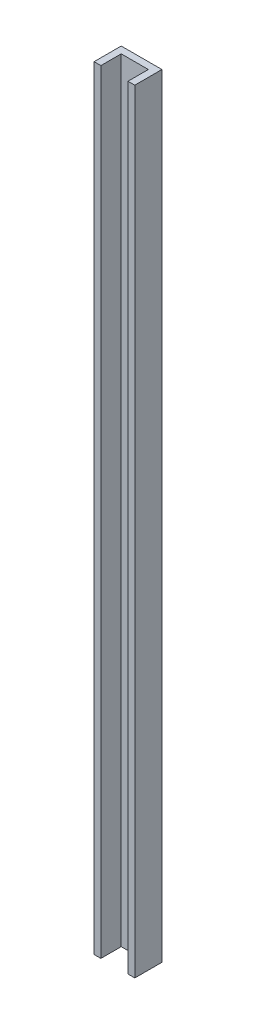
ISO-10303-21;
HEADER;
FILE_DESCRIPTION(('STEP AP214'),'2;1');
FILE_NAME('part.step','',(''),(''),'','','');
FILE_SCHEMA(('AUTOMOTIVE_DESIGN { 1 0 10303 214 1 1 1 1 }'));
ENDSEC;
DATA;
#1=APPLICATION_CONTEXT('core data for automotive mechanical design processes');
#2=APPLICATION_PROTOCOL_DEFINITION('international standard','automotive_design',2000,#1);
#3=PRODUCT_CONTEXT('',#1,'mechanical');
#4=PRODUCT('Part','Part','',(#3));
#5=PRODUCT_RELATED_PRODUCT_CATEGORY('part','',(#4));
#6=PRODUCT_DEFINITION_FORMATION('','',#4);
#7=PRODUCT_DEFINITION_CONTEXT('part definition',#1,'design');
#8=PRODUCT_DEFINITION('design','',#6,#7);
#9=PRODUCT_DEFINITION_SHAPE('','',#8);
#10=(LENGTH_UNIT() NAMED_UNIT(*) SI_UNIT(.MILLI.,.METRE.));
#11=(NAMED_UNIT(*) PLANE_ANGLE_UNIT() SI_UNIT($,.RADIAN.));
#12=(NAMED_UNIT(*) SI_UNIT($,.STERADIAN.) SOLID_ANGLE_UNIT());
#13=UNCERTAINTY_MEASURE_WITH_UNIT(LENGTH_MEASURE(1.E-05),#10,'distance_accuracy_value','');
#14=(GEOMETRIC_REPRESENTATION_CONTEXT(3) GLOBAL_UNCERTAINTY_ASSIGNED_CONTEXT((#13)) GLOBAL_UNIT_ASSIGNED_CONTEXT((#10,
#11,#12)) REPRESENTATION_CONTEXT('',''));
#15=CARTESIAN_POINT('',(0.,0.,0.));
#16=DIRECTION('',(0.,0.,1.));
#17=DIRECTION('',(1.,0.,0.));
#18=AXIS2_PLACEMENT_3D('',#15,#16,#17);
#19=CARTESIAN_POINT('',(3.175,361.95,0.));
#20=DIRECTION('',(0.,0.,-1.));
#21=DIRECTION('',(-1.,0.,0.));
#22=AXIS2_PLACEMENT_3D('',#19,#20,#21);
#23=PLANE('',#22);
#24=DIRECTION('',(1.,0.,0.));
#25=VECTOR('',#24,1.);
#26=CARTESIAN_POINT('',(3.175,0.,0.));
#27=LINE('',#26,#25);
#28=CARTESIAN_POINT('',(0.,0.,0.));
#29=VERTEX_POINT('',#28);
#30=CARTESIAN_POINT('',(3.175,0.,0.));
#31=VERTEX_POINT('',#30);
#32=EDGE_CURVE('E129',#29,#31,#27,.T.);
#33=ORIENTED_EDGE('',*,*,#32,.T.);
#34=DIRECTION('',(0.,-1.,0.));
#35=VECTOR('',#34,1.);
#36=CARTESIAN_POINT('',(3.175,361.95,0.));
#37=LINE('',#36,#35);
#38=CARTESIAN_POINT('',(3.175,361.95,0.));
#39=VERTEX_POINT('',#38);
#40=EDGE_CURVE('E11',#39,#31,#37,.T.);
#41=ORIENTED_EDGE('',*,*,#40,.F.);
#42=DIRECTION('',(1.,0.,0.));
#43=VECTOR('',#42,1.);
#44=CARTESIAN_POINT('',(3.175,361.95,0.));
#45=LINE('',#44,#43);
#46=CARTESIAN_POINT('',(0.,361.95,0.));
#47=VERTEX_POINT('',#46);
#48=EDGE_CURVE('E143',#47,#39,#45,.T.);
#49=ORIENTED_EDGE('',*,*,#48,.F.);
#50=DIRECTION('',(0.,-1.,0.));
#51=VECTOR('',#50,1.);
#52=CARTESIAN_POINT('',(0.,361.95,0.));
#53=LINE('',#52,#51);
#54=EDGE_CURVE('E125',#47,#29,#53,.T.);
#55=ORIENTED_EDGE('',*,*,#54,.T.);
#56=EDGE_LOOP('',(#33,#41,#49,#55));
#57=FACE_BOUND('',#56,.T.);
#58=ADVANCED_FACE('F33',(#57),#23,.F.);
#59=CARTESIAN_POINT('',(3.175,361.95,-9.525));
#60=DIRECTION('',(-1.,0.,0.));
#61=DIRECTION('',(0.,0.,1.));
#62=AXIS2_PLACEMENT_3D('',#59,#60,#61);
#63=PLANE('',#62);
#64=DIRECTION('',(0.,0.,-1.));
#65=VECTOR('',#64,1.);
#66=CARTESIAN_POINT('',(3.175,0.,-9.525));
#67=LINE('',#66,#65);
#68=CARTESIAN_POINT('',(3.175,0.,-9.525));
#69=VERTEX_POINT('',#68);
#70=EDGE_CURVE('E132',#31,#69,#67,.T.);
#71=ORIENTED_EDGE('',*,*,#70,.T.);
#72=DIRECTION('',(0.,-1.,0.));
#73=VECTOR('',#72,1.);
#74=CARTESIAN_POINT('',(3.175,361.95,-9.525));
#75=LINE('',#74,#73);
#76=CARTESIAN_POINT('',(3.175,361.95,-9.525));
#77=VERTEX_POINT('',#76);
#78=EDGE_CURVE('E41',#77,#69,#75,.T.);
#79=ORIENTED_EDGE('',*,*,#78,.F.);
#80=DIRECTION('',(0.,0.,-1.));
#81=VECTOR('',#80,1.);
#82=CARTESIAN_POINT('',(3.175,361.95,-9.525));
#83=LINE('',#82,#81);
#84=EDGE_CURVE('E92',#39,#77,#83,.T.);
#85=ORIENTED_EDGE('',*,*,#84,.F.);
#86=ORIENTED_EDGE('',*,*,#40,.T.);
#87=EDGE_LOOP('',(#71,#79,#85,#86));
#88=FACE_BOUND('',#87,.T.);
#89=ADVANCED_FACE('F178',(#88),#63,.F.);
#90=CARTESIAN_POINT('',(15.875,361.95,-9.525));
#91=DIRECTION('',(0.,0.,-1.));
#92=DIRECTION('',(-1.,0.,0.));
#93=AXIS2_PLACEMENT_3D('',#90,#91,#92);
#94=PLANE('',#93);
#95=DIRECTION('',(1.,0.,0.));
#96=VECTOR('',#95,1.);
#97=CARTESIAN_POINT('',(15.875,0.,-9.525));
#98=LINE('',#97,#96);
#99=CARTESIAN_POINT('',(15.875,0.,-9.525));
#100=VERTEX_POINT('',#99);
#101=EDGE_CURVE('E134',#69,#100,#98,.T.);
#102=ORIENTED_EDGE('',*,*,#101,.T.);
#103=DIRECTION('',(0.,-1.,0.));
#104=VECTOR('',#103,1.);
#105=CARTESIAN_POINT('',(15.875,361.95,-9.525));
#106=LINE('',#105,#104);
#107=CARTESIAN_POINT('',(15.875,361.95,-9.525));
#108=VERTEX_POINT('',#107);
#109=EDGE_CURVE('E150',#108,#100,#106,.T.);
#110=ORIENTED_EDGE('',*,*,#109,.F.);
#111=DIRECTION('',(1.,0.,0.));
#112=VECTOR('',#111,1.);
#113=CARTESIAN_POINT('',(15.875,361.95,-9.525));
#114=LINE('',#113,#112);
#115=EDGE_CURVE('E158',#77,#108,#114,.T.);
#116=ORIENTED_EDGE('',*,*,#115,.F.);
#117=ORIENTED_EDGE('',*,*,#78,.T.);
#118=EDGE_LOOP('',(#102,#110,#116,#117));
#119=FACE_BOUND('',#118,.T.);
#120=ADVANCED_FACE('F156',(#119),#94,.F.);
#121=CARTESIAN_POINT('',(15.875,361.95,0.));
#122=DIRECTION('',(1.,0.,0.));
#123=DIRECTION('',(0.,0.,-1.));
#124=AXIS2_PLACEMENT_3D('',#121,#122,#123);
#125=PLANE('',#124);
#126=DIRECTION('',(0.,0.,1.));
#127=VECTOR('',#126,1.);
#128=CARTESIAN_POINT('',(15.875,0.,0.));
#129=LINE('',#128,#127);
#130=CARTESIAN_POINT('',(15.875,0.,0.));
#131=VERTEX_POINT('',#130);
#132=EDGE_CURVE('E136',#100,#131,#129,.T.);
#133=ORIENTED_EDGE('',*,*,#132,.T.);
#134=DIRECTION('',(0.,-1.,0.));
#135=VECTOR('',#134,1.);
#136=CARTESIAN_POINT('',(15.875,361.95,0.));
#137=LINE('',#136,#135);
#138=CARTESIAN_POINT('',(15.875,361.95,0.));
#139=VERTEX_POINT('',#138);
#140=EDGE_CURVE('E147',#139,#131,#137,.T.);
#141=ORIENTED_EDGE('',*,*,#140,.F.);
#142=DIRECTION('',(0.,0.,1.));
#143=VECTOR('',#142,1.);
#144=CARTESIAN_POINT('',(15.875,361.95,0.));
#145=LINE('',#144,#143);
#146=EDGE_CURVE('E170',#108,#139,#145,.T.);
#147=ORIENTED_EDGE('',*,*,#146,.F.);
#148=ORIENTED_EDGE('',*,*,#109,.T.);
#149=EDGE_LOOP('',(#133,#141,#147,#148));
#150=FACE_BOUND('',#149,.T.);
#151=ADVANCED_FACE('F166',(#150),#125,.F.);
#152=CARTESIAN_POINT('',(19.05,361.95,0.));
#153=DIRECTION('',(0.,0.,-1.));
#154=DIRECTION('',(-1.,0.,0.));
#155=AXIS2_PLACEMENT_3D('',#152,#153,#154);
#156=PLANE('',#155);
#157=DIRECTION('',(1.,0.,0.));
#158=VECTOR('',#157,1.);
#159=CARTESIAN_POINT('',(19.05,0.,0.));
#160=LINE('',#159,#158);
#161=CARTESIAN_POINT('',(19.05,0.,0.));
#162=VERTEX_POINT('',#161);
#163=EDGE_CURVE('E138',#131,#162,#160,.T.);
#164=ORIENTED_EDGE('',*,*,#163,.T.);
#165=DIRECTION('',(0.,-1.,0.));
#166=VECTOR('',#165,1.);
#167=CARTESIAN_POINT('',(19.05,361.95,0.));
#168=LINE('',#167,#166);
#169=CARTESIAN_POINT('',(19.05,361.95,0.));
#170=VERTEX_POINT('',#169);
#171=EDGE_CURVE('E120',#170,#162,#168,.T.);
#172=ORIENTED_EDGE('',*,*,#171,.F.);
#173=DIRECTION('',(1.,0.,0.));
#174=VECTOR('',#173,1.);
#175=CARTESIAN_POINT('',(19.05,361.95,0.));
#176=LINE('',#175,#174);
#177=EDGE_CURVE('E111',#139,#170,#176,.T.);
#178=ORIENTED_EDGE('',*,*,#177,.F.);
#179=ORIENTED_EDGE('',*,*,#140,.T.);
#180=EDGE_LOOP('',(#164,#172,#178,#179));
#181=FACE_BOUND('',#180,.T.);
#182=ADVANCED_FACE('F169',(#181),#156,.F.);
#183=CARTESIAN_POINT('',(19.05,361.95,-12.7));
#184=DIRECTION('',(-1.,0.,0.));
#185=DIRECTION('',(0.,0.,1.));
#186=AXIS2_PLACEMENT_3D('',#183,#184,#185);
#187=PLANE('',#186);
#188=DIRECTION('',(0.,0.,-1.));
#189=VECTOR('',#188,1.);
#190=CARTESIAN_POINT('',(19.05,0.,-12.7));
#191=LINE('',#190,#189);
#192=CARTESIAN_POINT('',(19.05,0.,-12.7));
#193=VERTEX_POINT('',#192);
#194=EDGE_CURVE('E119',#162,#193,#191,.T.);
#195=ORIENTED_EDGE('',*,*,#194,.T.);
#196=DIRECTION('',(0.,-1.,0.));
#197=VECTOR('',#196,1.);
#198=CARTESIAN_POINT('',(19.05,361.95,-12.7));
#199=LINE('',#198,#197);
#200=CARTESIAN_POINT('',(19.05,361.95,-12.7));
#201=VERTEX_POINT('',#200);
#202=EDGE_CURVE('E116',#201,#193,#199,.T.);
#203=ORIENTED_EDGE('',*,*,#202,.F.);
#204=DIRECTION('',(0.,0.,-1.));
#205=VECTOR('',#204,1.);
#206=CARTESIAN_POINT('',(19.05,361.95,-12.7));
#207=LINE('',#206,#205);
#208=EDGE_CURVE('E105',#170,#201,#207,.T.);
#209=ORIENTED_EDGE('',*,*,#208,.F.);
#210=ORIENTED_EDGE('',*,*,#171,.T.);
#211=EDGE_LOOP('',(#195,#203,#209,#210));
#212=FACE_BOUND('',#211,.T.);
#213=ADVANCED_FACE('F117',(#212),#187,.F.);
#214=CARTESIAN_POINT('',(0.,361.95,-12.7));
#215=DIRECTION('',(0.,0.,1.));
#216=DIRECTION('',(1.,0.,0.));
#217=AXIS2_PLACEMENT_3D('',#214,#215,#216);
#218=PLANE('',#217);
#219=DIRECTION('',(-1.,0.,0.));
#220=VECTOR('',#219,1.);
#221=CARTESIAN_POINT('',(0.,0.,-12.7));
#222=LINE('',#221,#220);
#223=CARTESIAN_POINT('',(0.,0.,-12.7));
#224=VERTEX_POINT('',#223);
#225=EDGE_CURVE('E78',#193,#224,#222,.T.);
#226=ORIENTED_EDGE('',*,*,#225,.T.);
#227=DIRECTION('',(0.,-1.,0.));
#228=VECTOR('',#227,1.);
#229=CARTESIAN_POINT('',(0.,361.95,-12.7));
#230=LINE('',#229,#228);
#231=CARTESIAN_POINT('',(0.,361.95,-12.7));
#232=VERTEX_POINT('',#231);
#233=EDGE_CURVE('E121',#232,#224,#230,.T.);
#234=ORIENTED_EDGE('',*,*,#233,.F.);
#235=DIRECTION('',(-1.,0.,0.));
#236=VECTOR('',#235,1.);
#237=CARTESIAN_POINT('',(0.,361.95,-12.7));
#238=LINE('',#237,#236);
#239=EDGE_CURVE('E109',#201,#232,#238,.T.);
#240=ORIENTED_EDGE('',*,*,#239,.F.);
#241=ORIENTED_EDGE('',*,*,#202,.T.);
#242=EDGE_LOOP('',(#226,#234,#240,#241));
#243=FACE_BOUND('',#242,.T.);
#244=ADVANCED_FACE('F123',(#243),#218,.F.);
#245=CARTESIAN_POINT('',(0.,361.95,0.));
#246=DIRECTION('',(1.,0.,0.));
#247=DIRECTION('',(0.,0.,-1.));
#248=AXIS2_PLACEMENT_3D('',#245,#246,#247);
#249=PLANE('',#248);
#250=DIRECTION('',(0.,0.,1.));
#251=VECTOR('',#250,1.);
#252=CARTESIAN_POINT('',(0.,0.,0.));
#253=LINE('',#252,#251);
#254=EDGE_CURVE('E84',#224,#29,#253,.T.);
#255=ORIENTED_EDGE('',*,*,#254,.T.);
#256=ORIENTED_EDGE('',*,*,#54,.F.);
#257=DIRECTION('',(0.,0.,1.));
#258=VECTOR('',#257,1.);
#259=CARTESIAN_POINT('',(0.,361.95,0.));
#260=LINE('',#259,#258);
#261=EDGE_CURVE('E49',#232,#47,#260,.T.);
#262=ORIENTED_EDGE('',*,*,#261,.F.);
#263=ORIENTED_EDGE('',*,*,#233,.T.);
#264=EDGE_LOOP('',(#255,#256,#262,#263));
#265=FACE_BOUND('',#264,.T.);
#266=ADVANCED_FACE('F194',(#265),#249,.F.);
#267=CARTESIAN_POINT('',(0.,361.95,0.));
#268=DIRECTION('',(0.,-1.,0.));
#269=DIRECTION('',(0.,0.,-1.));
#270=AXIS2_PLACEMENT_3D('',#267,#268,#269);
#271=PLANE('',#270);
#272=ORIENTED_EDGE('',*,*,#48,.T.);
#273=ORIENTED_EDGE('',*,*,#84,.T.);
#274=ORIENTED_EDGE('',*,*,#115,.T.);
#275=ORIENTED_EDGE('',*,*,#146,.T.);
#276=ORIENTED_EDGE('',*,*,#177,.T.);
#277=ORIENTED_EDGE('',*,*,#208,.T.);
#278=ORIENTED_EDGE('',*,*,#239,.T.);
#279=ORIENTED_EDGE('',*,*,#261,.T.);
#280=EDGE_LOOP('',(#272,#273,#274,#275,#276,#277,#278,#279));
#281=FACE_BOUND('',#280,.T.);
#282=ADVANCED_FACE('F107',(#281),#271,.F.);
#283=CARTESIAN_POINT('',(0.,0.,0.));
#284=DIRECTION('',(0.,-1.,0.));
#285=DIRECTION('',(0.,0.,-1.));
#286=AXIS2_PLACEMENT_3D('',#283,#284,#285);
#287=PLANE('',#286);
#288=ORIENTED_EDGE('',*,*,#32,.F.);
#289=ORIENTED_EDGE('',*,*,#254,.F.);
#290=ORIENTED_EDGE('',*,*,#225,.F.);
#291=ORIENTED_EDGE('',*,*,#194,.F.);
#292=ORIENTED_EDGE('',*,*,#163,.F.);
#293=ORIENTED_EDGE('',*,*,#132,.F.);
#294=ORIENTED_EDGE('',*,*,#101,.F.);
#295=ORIENTED_EDGE('',*,*,#70,.F.);
#296=EDGE_LOOP('',(#288,#289,#290,#291,#292,#293,#294,#295));
#297=FACE_BOUND('',#296,.T.);
#298=ADVANCED_FACE('F162',(#297),#287,.T.);
#299=CLOSED_SHELL('',(#58,#89,#120,#151,#182,#213,#244,#266,#282,#298));
#300=MANIFOLD_SOLID_BREP('B2',#299);
#301=ADVANCED_BREP_SHAPE_REPRESENTATION('',(#18,#300),#14);
#302=SHAPE_DEFINITION_REPRESENTATION(#9,#301);
ENDSEC;
END-ISO-10303-21;
